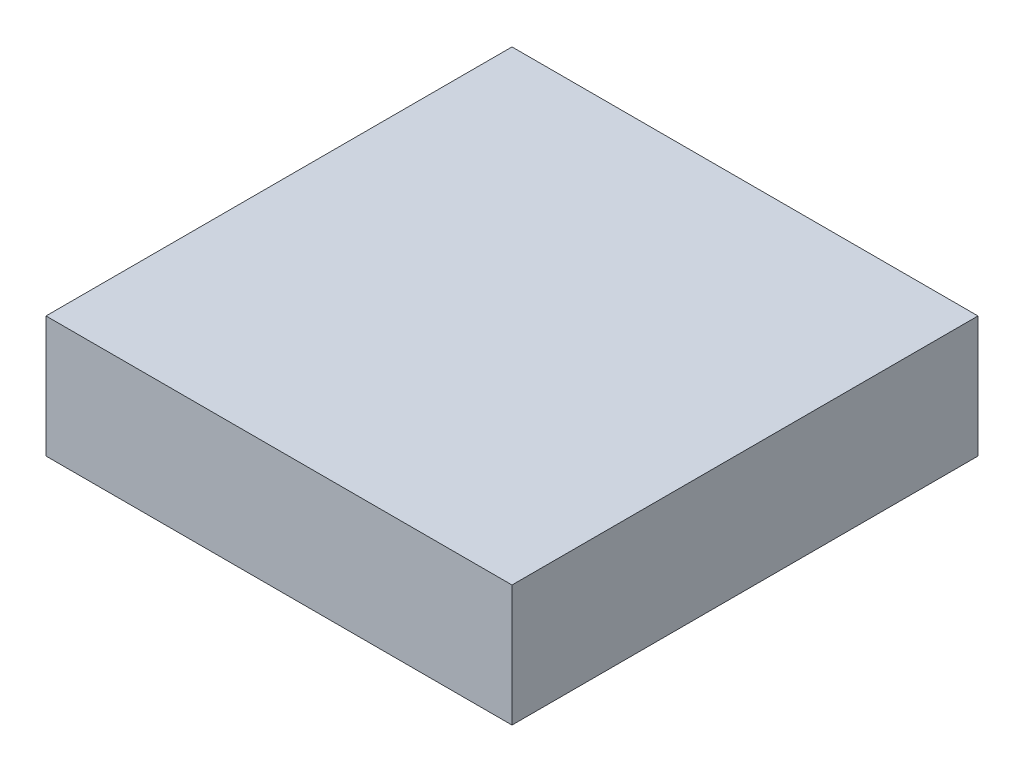
ISO-10303-21;
HEADER;
FILE_DESCRIPTION(('STEP AP214'),'2;1');
FILE_NAME('part.step','',(''),(''),'','','');
FILE_SCHEMA(('AUTOMOTIVE_DESIGN { 1 0 10303 214 1 1 1 1 }'));
ENDSEC;
DATA;
#1=APPLICATION_CONTEXT('core data for automotive mechanical design processes');
#2=APPLICATION_PROTOCOL_DEFINITION('international standard','automotive_design',2000,#1);
#3=PRODUCT_CONTEXT('',#1,'mechanical');
#4=PRODUCT('Part','Part','',(#3));
#5=PRODUCT_RELATED_PRODUCT_CATEGORY('part','',(#4));
#6=PRODUCT_DEFINITION_FORMATION('','',#4);
#7=PRODUCT_DEFINITION_CONTEXT('part definition',#1,'design');
#8=PRODUCT_DEFINITION('design','',#6,#7);
#9=PRODUCT_DEFINITION_SHAPE('','',#8);
#10=(LENGTH_UNIT() NAMED_UNIT(*) SI_UNIT(.MILLI.,.METRE.));
#11=(NAMED_UNIT(*) PLANE_ANGLE_UNIT() SI_UNIT($,.RADIAN.));
#12=(NAMED_UNIT(*) SI_UNIT($,.STERADIAN.) SOLID_ANGLE_UNIT());
#13=UNCERTAINTY_MEASURE_WITH_UNIT(LENGTH_MEASURE(1.E-05),#10,'distance_accuracy_value','');
#14=(GEOMETRIC_REPRESENTATION_CONTEXT(3) GLOBAL_UNCERTAINTY_ASSIGNED_CONTEXT((#13)) GLOBAL_UNIT_ASSIGNED_CONTEXT((#10,
#11,#12)) REPRESENTATION_CONTEXT('',''));
#15=CARTESIAN_POINT('',(0.,0.,0.));
#16=DIRECTION('',(0.,0.,1.));
#17=DIRECTION('',(1.,0.,0.));
#18=AXIS2_PLACEMENT_3D('',#15,#16,#17);
#19=CARTESIAN_POINT('',(-48.,12.5,-48.));
#20=DIRECTION('',(1.,0.,0.));
#21=DIRECTION('',(0.,0.,-1.));
#22=AXIS2_PLACEMENT_3D('',#19,#20,#21);
#23=PLANE('',#22);
#24=DIRECTION('',(0.,0.,1.));
#25=VECTOR('',#24,1.);
#26=CARTESIAN_POINT('',(-48.,-12.5,-48.));
#27=LINE('',#26,#25);
#28=CARTESIAN_POINT('',(-48.,-12.5,-48.));
#29=VERTEX_POINT('',#28);
#30=CARTESIAN_POINT('',(-48.,-12.5,48.));
#31=VERTEX_POINT('',#30);
#32=EDGE_CURVE('E113',#29,#31,#27,.T.);
#33=ORIENTED_EDGE('',*,*,#32,.T.);
#34=DIRECTION('',(0.,-1.,0.));
#35=VECTOR('',#34,1.);
#36=CARTESIAN_POINT('',(-48.,12.5,48.));
#37=LINE('',#36,#35);
#38=CARTESIAN_POINT('',(-48.,12.5,48.));
#39=VERTEX_POINT('',#38);
#40=EDGE_CURVE('E11',#39,#31,#37,.T.);
#41=ORIENTED_EDGE('',*,*,#40,.F.);
#42=DIRECTION('',(0.,0.,1.));
#43=VECTOR('',#42,1.);
#44=CARTESIAN_POINT('',(-48.,12.5,-48.));
#45=LINE('',#44,#43);
#46=CARTESIAN_POINT('',(-48.,12.5,-48.));
#47=VERTEX_POINT('',#46);
#48=EDGE_CURVE('E97',#47,#39,#45,.T.);
#49=ORIENTED_EDGE('',*,*,#48,.F.);
#50=DIRECTION('',(0.,-1.,0.));
#51=VECTOR('',#50,1.);
#52=CARTESIAN_POINT('',(-48.,12.5,-48.));
#53=LINE('',#52,#51);
#54=EDGE_CURVE('E109',#47,#29,#53,.T.);
#55=ORIENTED_EDGE('',*,*,#54,.T.);
#56=EDGE_LOOP('',(#33,#41,#49,#55));
#57=FACE_BOUND('',#56,.T.);
#58=ADVANCED_FACE('F45',(#57),#23,.F.);
#59=CARTESIAN_POINT('',(-48.,12.5,48.));
#60=DIRECTION('',(0.,0.,-1.));
#61=DIRECTION('',(-1.,0.,0.));
#62=AXIS2_PLACEMENT_3D('',#59,#60,#61);
#63=PLANE('',#62);
#64=DIRECTION('',(1.,0.,0.));
#65=VECTOR('',#64,1.);
#66=CARTESIAN_POINT('',(-48.,-12.5,48.));
#67=LINE('',#66,#65);
#68=CARTESIAN_POINT('',(48.,-12.5,48.));
#69=VERTEX_POINT('',#68);
#70=EDGE_CURVE('E102',#31,#69,#67,.T.);
#71=ORIENTED_EDGE('',*,*,#70,.T.);
#72=DIRECTION('',(0.,-1.,0.));
#73=VECTOR('',#72,1.);
#74=CARTESIAN_POINT('',(48.,12.5,48.));
#75=LINE('',#74,#73);
#76=CARTESIAN_POINT('',(48.,12.5,48.));
#77=VERTEX_POINT('',#76);
#78=EDGE_CURVE('E54',#77,#69,#75,.T.);
#79=ORIENTED_EDGE('',*,*,#78,.F.);
#80=DIRECTION('',(1.,0.,0.));
#81=VECTOR('',#80,1.);
#82=CARTESIAN_POINT('',(-48.,12.5,48.));
#83=LINE('',#82,#81);
#84=EDGE_CURVE('E92',#39,#77,#83,.T.);
#85=ORIENTED_EDGE('',*,*,#84,.F.);
#86=ORIENTED_EDGE('',*,*,#40,.T.);
#87=EDGE_LOOP('',(#71,#79,#85,#86));
#88=FACE_BOUND('',#87,.T.);
#89=ADVANCED_FACE('F101',(#88),#63,.F.);
#90=CARTESIAN_POINT('',(48.,12.5,-48.));
#91=DIRECTION('',(-1.,0.,0.));
#92=DIRECTION('',(0.,0.,1.));
#93=AXIS2_PLACEMENT_3D('',#90,#91,#92);
#94=PLANE('',#93);
#95=DIRECTION('',(0.,0.,-1.));
#96=VECTOR('',#95,1.);
#97=CARTESIAN_POINT('',(48.,-12.5,-48.));
#98=LINE('',#97,#96);
#99=CARTESIAN_POINT('',(48.,-12.5,-48.));
#100=VERTEX_POINT('',#99);
#101=EDGE_CURVE('E79',#69,#100,#98,.T.);
#102=ORIENTED_EDGE('',*,*,#101,.T.);
#103=DIRECTION('',(0.,-1.,0.));
#104=VECTOR('',#103,1.);
#105=CARTESIAN_POINT('',(48.,12.5,-48.));
#106=LINE('',#105,#104);
#107=CARTESIAN_POINT('',(48.,12.5,-48.));
#108=VERTEX_POINT('',#107);
#109=EDGE_CURVE('E104',#108,#100,#106,.T.);
#110=ORIENTED_EDGE('',*,*,#109,.F.);
#111=DIRECTION('',(0.,0.,-1.));
#112=VECTOR('',#111,1.);
#113=CARTESIAN_POINT('',(48.,12.5,-48.));
#114=LINE('',#113,#112);
#115=EDGE_CURVE('E95',#77,#108,#114,.T.);
#116=ORIENTED_EDGE('',*,*,#115,.F.);
#117=ORIENTED_EDGE('',*,*,#78,.T.);
#118=EDGE_LOOP('',(#102,#110,#116,#117));
#119=FACE_BOUND('',#118,.T.);
#120=ADVANCED_FACE('F105',(#119),#94,.F.);
#121=CARTESIAN_POINT('',(-48.,12.5,-48.));
#122=DIRECTION('',(0.,0.,1.));
#123=DIRECTION('',(1.,0.,0.));
#124=AXIS2_PLACEMENT_3D('',#121,#122,#123);
#125=PLANE('',#124);
#126=DIRECTION('',(-1.,0.,0.));
#127=VECTOR('',#126,1.);
#128=CARTESIAN_POINT('',(-48.,-12.5,-48.));
#129=LINE('',#128,#127);
#130=EDGE_CURVE('E85',#100,#29,#129,.T.);
#131=ORIENTED_EDGE('',*,*,#130,.T.);
#132=ORIENTED_EDGE('',*,*,#54,.F.);
#133=DIRECTION('',(-1.,0.,0.));
#134=VECTOR('',#133,1.);
#135=CARTESIAN_POINT('',(-48.,12.5,-48.));
#136=LINE('',#135,#134);
#137=EDGE_CURVE('E62',#108,#47,#136,.T.);
#138=ORIENTED_EDGE('',*,*,#137,.F.);
#139=ORIENTED_EDGE('',*,*,#109,.T.);
#140=EDGE_LOOP('',(#131,#132,#138,#139));
#141=FACE_BOUND('',#140,.T.);
#142=ADVANCED_FACE('F126',(#141),#125,.F.);
#143=CARTESIAN_POINT('',(0.,12.5,0.));
#144=DIRECTION('',(0.,1.,0.));
#145=DIRECTION('',(0.,0.,1.));
#146=AXIS2_PLACEMENT_3D('',#143,#144,#145);
#147=PLANE('',#146);
#148=ORIENTED_EDGE('',*,*,#48,.T.);
#149=ORIENTED_EDGE('',*,*,#84,.T.);
#150=ORIENTED_EDGE('',*,*,#115,.T.);
#151=ORIENTED_EDGE('',*,*,#137,.T.);
#152=EDGE_LOOP('',(#148,#149,#150,#151));
#153=FACE_BOUND('',#152,.T.);
#154=ADVANCED_FACE('F93',(#153),#147,.T.);
#155=CARTESIAN_POINT('',(0.,-12.5,0.));
#156=DIRECTION('',(0.,1.,0.));
#157=DIRECTION('',(0.,0.,1.));
#158=AXIS2_PLACEMENT_3D('',#155,#156,#157);
#159=PLANE('',#158);
#160=ORIENTED_EDGE('',*,*,#32,.F.);
#161=ORIENTED_EDGE('',*,*,#130,.F.);
#162=ORIENTED_EDGE('',*,*,#101,.F.);
#163=ORIENTED_EDGE('',*,*,#70,.F.);
#164=EDGE_LOOP('',(#160,#161,#162,#163));
#165=FACE_BOUND('',#164,.T.);
#166=ADVANCED_FACE('F129',(#165),#159,.F.);
#167=CLOSED_SHELL('',(#58,#89,#120,#142,#154,#166));
#168=MANIFOLD_SOLID_BREP('B2',#167);
#169=ADVANCED_BREP_SHAPE_REPRESENTATION('',(#18,#168),#14);
#170=SHAPE_DEFINITION_REPRESENTATION(#9,#169);
ENDSEC;
END-ISO-10303-21;
